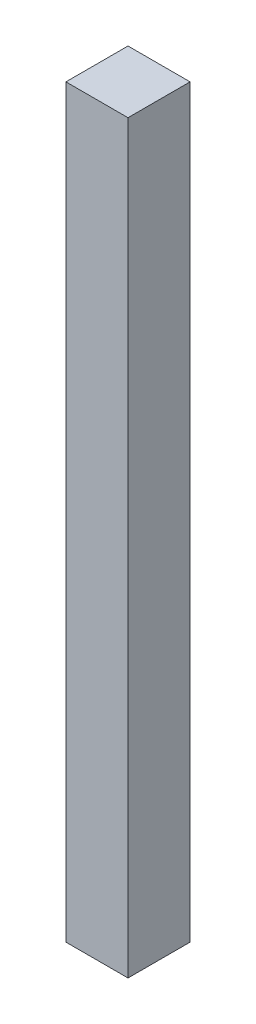
ISO-10303-21;
HEADER;
FILE_DESCRIPTION(('STEP AP214'),'2;1');
FILE_NAME('part.step','',(''),(''),'','','');
FILE_SCHEMA(('AUTOMOTIVE_DESIGN { 1 0 10303 214 1 1 1 1 }'));
ENDSEC;
DATA;
#1=APPLICATION_CONTEXT('core data for automotive mechanical design processes');
#2=APPLICATION_PROTOCOL_DEFINITION('international standard','automotive_design',2000,#1);
#3=PRODUCT_CONTEXT('',#1,'mechanical');
#4=PRODUCT('Part','Part','',(#3));
#5=PRODUCT_RELATED_PRODUCT_CATEGORY('part','',(#4));
#6=PRODUCT_DEFINITION_FORMATION('','',#4);
#7=PRODUCT_DEFINITION_CONTEXT('part definition',#1,'design');
#8=PRODUCT_DEFINITION('design','',#6,#7);
#9=PRODUCT_DEFINITION_SHAPE('','',#8);
#10=(LENGTH_UNIT() NAMED_UNIT(*) SI_UNIT(.MILLI.,.METRE.));
#11=(NAMED_UNIT(*) PLANE_ANGLE_UNIT() SI_UNIT($,.RADIAN.));
#12=(NAMED_UNIT(*) SI_UNIT($,.STERADIAN.) SOLID_ANGLE_UNIT());
#13=UNCERTAINTY_MEASURE_WITH_UNIT(LENGTH_MEASURE(1.E-05),#10,'distance_accuracy_value','');
#14=(GEOMETRIC_REPRESENTATION_CONTEXT(3) GLOBAL_UNCERTAINTY_ASSIGNED_CONTEXT((#13)) GLOBAL_UNIT_ASSIGNED_CONTEXT((#10,
#11,#12)) REPRESENTATION_CONTEXT('',''));
#15=CARTESIAN_POINT('',(0.,0.,0.));
#16=DIRECTION('',(0.,0.,1.));
#17=DIRECTION('',(1.,0.,0.));
#18=AXIS2_PLACEMENT_3D('',#15,#16,#17);
#19=CARTESIAN_POINT('',(-6.66794390067782,304.8,-5.36003519511604));
#20=DIRECTION('',(1.,0.,0.));
#21=DIRECTION('',(0.,0.,-1.));
#22=AXIS2_PLACEMENT_3D('',#19,#20,#21);
#23=PLANE('',#22);
#24=DIRECTION('',(0.,0.,1.));
#25=VECTOR('',#24,1.);
#26=CARTESIAN_POINT('',(-6.66794390067782,0.,-5.36003519511604));
#27=LINE('',#26,#25);
#28=CARTESIAN_POINT('',(-6.66794390067782,0.,-5.36003519511604));
#29=VERTEX_POINT('',#28);
#30=CARTESIAN_POINT('',(-6.66794390067782,0.,20.039964804884));
#31=VERTEX_POINT('',#30);
#32=EDGE_CURVE('E115',#29,#31,#27,.T.);
#33=ORIENTED_EDGE('',*,*,#32,.T.);
#34=DIRECTION('',(0.,-1.,0.));
#35=VECTOR('',#34,1.);
#36=CARTESIAN_POINT('',(-6.66794390067782,304.8,20.039964804884));
#37=LINE('',#36,#35);
#38=CARTESIAN_POINT('',(-6.66794390067782,304.8,20.039964804884));
#39=VERTEX_POINT('',#38);
#40=EDGE_CURVE('E11',#39,#31,#37,.T.);
#41=ORIENTED_EDGE('',*,*,#40,.F.);
#42=DIRECTION('',(0.,0.,1.));
#43=VECTOR('',#42,1.);
#44=CARTESIAN_POINT('',(-6.66794390067782,304.8,-5.36003519511604));
#45=LINE('',#44,#43);
#46=CARTESIAN_POINT('',(-6.66794390067782,304.8,-5.36003519511604));
#47=VERTEX_POINT('',#46);
#48=EDGE_CURVE('E98',#47,#39,#45,.T.);
#49=ORIENTED_EDGE('',*,*,#48,.F.);
#50=DIRECTION('',(0.,-1.,0.));
#51=VECTOR('',#50,1.);
#52=CARTESIAN_POINT('',(-6.66794390067782,304.8,-5.36003519511604));
#53=LINE('',#52,#51);
#54=EDGE_CURVE('E111',#47,#29,#53,.T.);
#55=ORIENTED_EDGE('',*,*,#54,.T.);
#56=EDGE_LOOP('',(#33,#41,#49,#55));
#57=FACE_BOUND('',#56,.T.);
#58=ADVANCED_FACE('F38',(#57),#23,.F.);
#59=CARTESIAN_POINT('',(-6.66794390067782,304.8,20.039964804884));
#60=DIRECTION('',(0.,0.,-1.));
#61=DIRECTION('',(-1.,0.,0.));
#62=AXIS2_PLACEMENT_3D('',#59,#60,#61);
#63=PLANE('',#62);
#64=DIRECTION('',(1.,0.,0.));
#65=VECTOR('',#64,1.);
#66=CARTESIAN_POINT('',(-6.66794390067782,0.,20.039964804884));
#67=LINE('',#66,#65);
#68=CARTESIAN_POINT('',(18.7320560993222,0.,20.039964804884));
#69=VERTEX_POINT('',#68);
#70=EDGE_CURVE('E103',#31,#69,#67,.T.);
#71=ORIENTED_EDGE('',*,*,#70,.T.);
#72=DIRECTION('',(0.,-1.,0.));
#73=VECTOR('',#72,1.);
#74=CARTESIAN_POINT('',(18.7320560993222,304.8,20.039964804884));
#75=LINE('',#74,#73);
#76=CARTESIAN_POINT('',(18.7320560993222,304.8,20.039964804884));
#77=VERTEX_POINT('',#76);
#78=EDGE_CURVE('E47',#77,#69,#75,.T.);
#79=ORIENTED_EDGE('',*,*,#78,.F.);
#80=DIRECTION('',(1.,0.,0.));
#81=VECTOR('',#80,1.);
#82=CARTESIAN_POINT('',(-6.66794390067782,304.8,20.039964804884));
#83=LINE('',#82,#81);
#84=EDGE_CURVE('E93',#39,#77,#83,.T.);
#85=ORIENTED_EDGE('',*,*,#84,.F.);
#86=ORIENTED_EDGE('',*,*,#40,.T.);
#87=EDGE_LOOP('',(#71,#79,#85,#86));
#88=FACE_BOUND('',#87,.T.);
#89=ADVANCED_FACE('F102',(#88),#63,.F.);
#90=CARTESIAN_POINT('',(18.7320560993222,304.8,-5.36003519511604));
#91=DIRECTION('',(-1.,0.,0.));
#92=DIRECTION('',(0.,0.,1.));
#93=AXIS2_PLACEMENT_3D('',#90,#91,#92);
#94=PLANE('',#93);
#95=DIRECTION('',(0.,0.,-1.));
#96=VECTOR('',#95,1.);
#97=CARTESIAN_POINT('',(18.7320560993222,0.,-5.36003519511604));
#98=LINE('',#97,#96);
#99=CARTESIAN_POINT('',(18.7320560993222,0.,-5.36003519511604));
#100=VERTEX_POINT('',#99);
#101=EDGE_CURVE('E79',#69,#100,#98,.T.);
#102=ORIENTED_EDGE('',*,*,#101,.T.);
#103=DIRECTION('',(0.,-1.,0.));
#104=VECTOR('',#103,1.);
#105=CARTESIAN_POINT('',(18.7320560993222,304.8,-5.36003519511604));
#106=LINE('',#105,#104);
#107=CARTESIAN_POINT('',(18.7320560993222,304.8,-5.36003519511604));
#108=VERTEX_POINT('',#107);
#109=EDGE_CURVE('E105',#108,#100,#106,.T.);
#110=ORIENTED_EDGE('',*,*,#109,.F.);
#111=DIRECTION('',(0.,0.,-1.));
#112=VECTOR('',#111,1.);
#113=CARTESIAN_POINT('',(18.7320560993222,304.8,-5.36003519511604));
#114=LINE('',#113,#112);
#115=EDGE_CURVE('E96',#77,#108,#114,.T.);
#116=ORIENTED_EDGE('',*,*,#115,.F.);
#117=ORIENTED_EDGE('',*,*,#78,.T.);
#118=EDGE_LOOP('',(#102,#110,#116,#117));
#119=FACE_BOUND('',#118,.T.);
#120=ADVANCED_FACE('F106',(#119),#94,.F.);
#121=CARTESIAN_POINT('',(-6.66794390067782,304.8,-5.36003519511604));
#122=DIRECTION('',(0.,0.,1.));
#123=DIRECTION('',(1.,0.,0.));
#124=AXIS2_PLACEMENT_3D('',#121,#122,#123);
#125=PLANE('',#124);
#126=DIRECTION('',(-1.,0.,0.));
#127=VECTOR('',#126,1.);
#128=CARTESIAN_POINT('',(-6.66794390067782,0.,-5.36003519511604));
#129=LINE('',#128,#127);
#130=EDGE_CURVE('E86',#100,#29,#129,.T.);
#131=ORIENTED_EDGE('',*,*,#130,.T.);
#132=ORIENTED_EDGE('',*,*,#54,.F.);
#133=DIRECTION('',(-1.,0.,0.));
#134=VECTOR('',#133,1.);
#135=CARTESIAN_POINT('',(-6.66794390067782,304.8,-5.36003519511604));
#136=LINE('',#135,#134);
#137=EDGE_CURVE('E57',#108,#47,#136,.T.);
#138=ORIENTED_EDGE('',*,*,#137,.F.);
#139=ORIENTED_EDGE('',*,*,#109,.T.);
#140=EDGE_LOOP('',(#131,#132,#138,#139));
#141=FACE_BOUND('',#140,.T.);
#142=ADVANCED_FACE('F128',(#141),#125,.F.);
#143=CARTESIAN_POINT('',(0.,304.8,0.));
#144=DIRECTION('',(0.,1.,0.));
#145=DIRECTION('',(0.,0.,1.));
#146=AXIS2_PLACEMENT_3D('',#143,#144,#145);
#147=PLANE('',#146);
#148=ORIENTED_EDGE('',*,*,#48,.T.);
#149=ORIENTED_EDGE('',*,*,#84,.T.);
#150=ORIENTED_EDGE('',*,*,#115,.T.);
#151=ORIENTED_EDGE('',*,*,#137,.T.);
#152=EDGE_LOOP('',(#148,#149,#150,#151));
#153=FACE_BOUND('',#152,.T.);
#154=ADVANCED_FACE('F94',(#153),#147,.T.);
#155=CARTESIAN_POINT('',(0.,0.,0.));
#156=DIRECTION('',(0.,1.,0.));
#157=DIRECTION('',(0.,0.,1.));
#158=AXIS2_PLACEMENT_3D('',#155,#156,#157);
#159=PLANE('',#158);
#160=ORIENTED_EDGE('',*,*,#32,.F.);
#161=ORIENTED_EDGE('',*,*,#130,.F.);
#162=ORIENTED_EDGE('',*,*,#101,.F.);
#163=ORIENTED_EDGE('',*,*,#70,.F.);
#164=EDGE_LOOP('',(#160,#161,#162,#163));
#165=FACE_BOUND('',#164,.T.);
#166=ADVANCED_FACE('F131',(#165),#159,.F.);
#167=CLOSED_SHELL('',(#58,#89,#120,#142,#154,#166));
#168=MANIFOLD_SOLID_BREP('B2',#167);
#169=ADVANCED_BREP_SHAPE_REPRESENTATION('',(#18,#168),#14);
#170=SHAPE_DEFINITION_REPRESENTATION(#9,#169);
ENDSEC;
END-ISO-10303-21;
